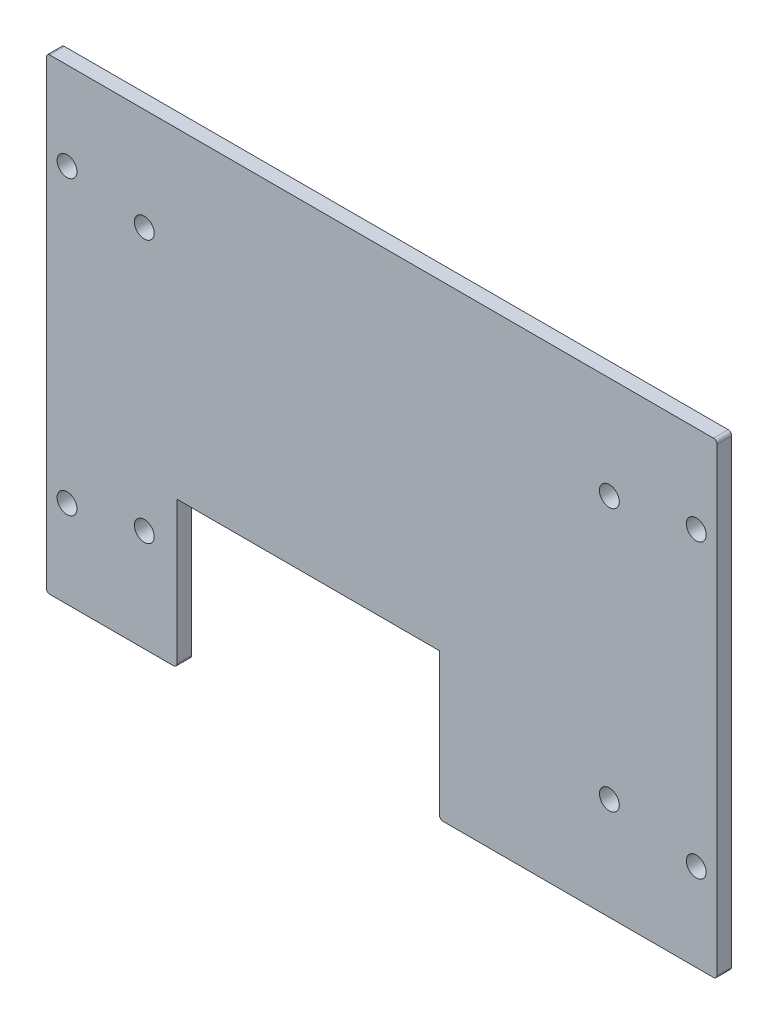
ISO-10303-21;
HEADER;
FILE_DESCRIPTION(('STEP AP214'),'2;1');
FILE_NAME('part.step','',(''),(''),'','','');
FILE_SCHEMA(('AUTOMOTIVE_DESIGN { 1 0 10303 214 1 1 1 1 }'));
ENDSEC;
DATA;
#1=APPLICATION_CONTEXT('core data for automotive mechanical design processes');
#2=APPLICATION_PROTOCOL_DEFINITION('international standard','automotive_design',2000,#1);
#3=PRODUCT_CONTEXT('',#1,'mechanical');
#4=PRODUCT('Part','Part','',(#3));
#5=PRODUCT_RELATED_PRODUCT_CATEGORY('part','',(#4));
#6=PRODUCT_DEFINITION_FORMATION('','',#4);
#7=PRODUCT_DEFINITION_CONTEXT('part definition',#1,'design');
#8=PRODUCT_DEFINITION('design','',#6,#7);
#9=PRODUCT_DEFINITION_SHAPE('','',#8);
#10=(LENGTH_UNIT() NAMED_UNIT(*) SI_UNIT(.MILLI.,.METRE.));
#11=(NAMED_UNIT(*) PLANE_ANGLE_UNIT() SI_UNIT($,.RADIAN.));
#12=(NAMED_UNIT(*) SI_UNIT($,.STERADIAN.) SOLID_ANGLE_UNIT());
#13=UNCERTAINTY_MEASURE_WITH_UNIT(LENGTH_MEASURE(1.E-05),#10,'distance_accuracy_value','');
#14=(GEOMETRIC_REPRESENTATION_CONTEXT(3) GLOBAL_UNCERTAINTY_ASSIGNED_CONTEXT((#13)) GLOBAL_UNIT_ASSIGNED_CONTEXT((#10,
#11,#12)) REPRESENTATION_CONTEXT('',''));
#15=CARTESIAN_POINT('',(0.,0.,0.));
#16=DIRECTION('',(0.,0.,1.));
#17=DIRECTION('',(1.,0.,0.));
#18=AXIS2_PLACEMENT_3D('',#15,#16,#17);
#19=CARTESIAN_POINT('',(0.,0.,3.2004));
#20=DIRECTION('',(0.,1.,0.));
#21=DIRECTION('',(0.,0.,1.));
#22=AXIS2_PLACEMENT_3D('',#19,#20,#21);
#23=PLANE('',#22);
#24=DIRECTION('',(1.,0.,0.));
#25=VECTOR('',#24,1.);
#26=CARTESIAN_POINT('',(0.,0.,0.));
#27=LINE('',#26,#25);
#28=CARTESIAN_POINT('',(0.762,0.,0.));
#29=VERTEX_POINT('',#28);
#30=CARTESIAN_POINT('',(27.67076,0.,0.));
#31=VERTEX_POINT('',#30);
#32=EDGE_CURVE('E187',#29,#31,#27,.T.);
#33=ORIENTED_EDGE('',*,*,#32,.T.);
#34=DIRECTION('',(0.,0.,1.));
#35=VECTOR('',#34,1.);
#36=CARTESIAN_POINT('',(27.67076,0.,3.2004));
#37=LINE('',#36,#35);
#38=CARTESIAN_POINT('',(27.67076,0.,3.2004));
#39=VERTEX_POINT('',#38);
#40=EDGE_CURVE('E227',#31,#39,#37,.T.);
#41=ORIENTED_EDGE('',*,*,#40,.T.);
#42=DIRECTION('',(1.,0.,0.));
#43=VECTOR('',#42,1.);
#44=CARTESIAN_POINT('',(0.,0.,3.2004));
#45=LINE('',#44,#43);
#46=CARTESIAN_POINT('',(0.762,0.,3.2004));
#47=VERTEX_POINT('',#46);
#48=EDGE_CURVE('E171',#47,#39,#45,.T.);
#49=ORIENTED_EDGE('',*,*,#48,.F.);
#50=DIRECTION('',(0.,0.,-1.));
#51=VECTOR('',#50,1.);
#52=CARTESIAN_POINT('',(0.762,0.,3.2004));
#53=LINE('',#52,#51);
#54=EDGE_CURVE('E224',#47,#29,#53,.T.);
#55=ORIENTED_EDGE('',*,*,#54,.T.);
#56=EDGE_LOOP('',(#33,#41,#49,#55));
#57=FACE_BOUND('',#56,.T.);
#58=ADVANCED_FACE('F33',(#57),#23,.F.);
#59=CARTESIAN_POINT('',(0.,101.6,3.2004));
#60=DIRECTION('',(1.,0.,0.));
#61=DIRECTION('',(0.,1.,0.));
#62=AXIS2_PLACEMENT_3D('',#59,#60,#61);
#63=PLANE('',#62);
#64=DIRECTION('',(0.,-1.,0.));
#65=VECTOR('',#64,1.);
#66=CARTESIAN_POINT('',(0.,101.6,0.));
#67=LINE('',#66,#65);
#68=CARTESIAN_POINT('',(0.,100.838,0.));
#69=VERTEX_POINT('',#68);
#70=CARTESIAN_POINT('',(0.,0.761999999999999,0.));
#71=VERTEX_POINT('',#70);
#72=EDGE_CURVE('E180',#69,#71,#67,.T.);
#73=ORIENTED_EDGE('',*,*,#72,.T.);
#74=DIRECTION('',(0.,0.,-1.));
#75=VECTOR('',#74,1.);
#76=CARTESIAN_POINT('',(0.,0.761999999999999,3.2004));
#77=LINE('',#76,#75);
#78=CARTESIAN_POINT('',(0.,0.761999999999999,3.2004));
#79=VERTEX_POINT('',#78);
#80=EDGE_CURVE('E234',#71,#79,#77,.F.);
#81=ORIENTED_EDGE('',*,*,#80,.T.);
#82=DIRECTION('',(0.,-1.,0.));
#83=VECTOR('',#82,1.);
#84=CARTESIAN_POINT('',(0.,101.6,3.2004));
#85=LINE('',#84,#83);
#86=CARTESIAN_POINT('',(0.,100.838,3.2004));
#87=VERTEX_POINT('',#86);
#88=EDGE_CURVE('E167',#87,#79,#85,.T.);
#89=ORIENTED_EDGE('',*,*,#88,.F.);
#90=DIRECTION('',(0.,0.,-1.));
#91=VECTOR('',#90,1.);
#92=CARTESIAN_POINT('',(0.,100.838,3.2004));
#93=LINE('',#92,#91);
#94=EDGE_CURVE('E231',#87,#69,#93,.T.);
#95=ORIENTED_EDGE('',*,*,#94,.T.);
#96=EDGE_LOOP('',(#73,#81,#89,#95));
#97=FACE_BOUND('',#96,.T.);
#98=ADVANCED_FACE('F248',(#97),#63,.F.);
#99=CARTESIAN_POINT('',(86.294760132,0.,0.));
#100=VERTEX_POINT('',#99);
#101=CARTESIAN_POINT('',(145.123353282042,0.,0.));
#102=VERTEX_POINT('',#101);
#103=EDGE_CURVE('E183',#100,#102,#27,.T.);
#104=ORIENTED_EDGE('',*,*,#103,.T.);
#105=DIRECTION('',(0.,0.,-1.));
#106=VECTOR('',#105,1.);
#107=CARTESIAN_POINT('',(145.123353282042,0.,3.2004));
#108=LINE('',#107,#106);
#109=CARTESIAN_POINT('',(145.123353282042,0.,3.2004));
#110=VERTEX_POINT('',#109);
#111=EDGE_CURVE('E211',#102,#110,#108,.F.);
#112=ORIENTED_EDGE('',*,*,#111,.T.);
#113=CARTESIAN_POINT('',(86.294760132,0.,3.2004));
#114=VERTEX_POINT('',#113);
#115=EDGE_CURVE('E169',#114,#110,#45,.T.);
#116=ORIENTED_EDGE('',*,*,#115,.F.);
#117=DIRECTION('',(0.,0.,1.));
#118=VECTOR('',#117,1.);
#119=CARTESIAN_POINT('',(86.294760132,0.,3.2004));
#120=LINE('',#119,#118);
#121=EDGE_CURVE('E209',#114,#100,#120,.F.);
#122=ORIENTED_EDGE('',*,*,#121,.T.);
#123=EDGE_LOOP('',(#104,#112,#116,#122));
#124=FACE_BOUND('',#123,.T.);
#125=ADVANCED_FACE('F346',(#124),#23,.F.);
#126=CARTESIAN_POINT('',(145.885353282042,101.6,3.2004));
#127=DIRECTION('',(-1.,0.,0.));
#128=DIRECTION('',(0.,0.,1.));
#129=AXIS2_PLACEMENT_3D('',#126,#127,#128);
#130=PLANE('',#129);
#131=DIRECTION('',(0.,1.,0.));
#132=VECTOR('',#131,1.);
#133=CARTESIAN_POINT('',(145.885353282042,101.6,3.2004));
#134=LINE('',#133,#132);
#135=CARTESIAN_POINT('',(145.885353282042,0.761999999999999,3.2004));
#136=VERTEX_POINT('',#135);
#137=CARTESIAN_POINT('',(145.885353282042,100.838,3.2004));
#138=VERTEX_POINT('',#137);
#139=EDGE_CURVE('E173',#136,#138,#134,.T.);
#140=ORIENTED_EDGE('',*,*,#139,.F.);
#141=DIRECTION('',(0.,0.,-1.));
#142=VECTOR('',#141,1.);
#143=CARTESIAN_POINT('',(145.885353282042,0.761999999999999,3.2004));
#144=LINE('',#143,#142);
#145=CARTESIAN_POINT('',(145.885353282042,0.761999999999999,0.));
#146=VERTEX_POINT('',#145);
#147=EDGE_CURVE('E194',#136,#146,#144,.T.);
#148=ORIENTED_EDGE('',*,*,#147,.T.);
#149=DIRECTION('',(0.,1.,0.));
#150=VECTOR('',#149,1.);
#151=CARTESIAN_POINT('',(145.885353282042,101.6,0.));
#152=LINE('',#151,#150);
#153=CARTESIAN_POINT('',(145.885353282042,100.838,0.));
#154=VERTEX_POINT('',#153);
#155=EDGE_CURVE('E188',#146,#154,#152,.T.);
#156=ORIENTED_EDGE('',*,*,#155,.T.);
#157=DIRECTION('',(0.,0.,-1.));
#158=VECTOR('',#157,1.);
#159=CARTESIAN_POINT('',(145.885353282042,100.838,3.2004));
#160=LINE('',#159,#158);
#161=EDGE_CURVE('E179',#154,#138,#160,.F.);
#162=ORIENTED_EDGE('',*,*,#161,.T.);
#163=EDGE_LOOP('',(#140,#148,#156,#162));
#164=FACE_BOUND('',#163,.T.);
#165=ADVANCED_FACE('F353',(#164),#130,.F.);
#166=CARTESIAN_POINT('',(0.,101.6,3.2004));
#167=DIRECTION('',(0.,-1.,0.));
#168=DIRECTION('',(0.,0.,-1.));
#169=AXIS2_PLACEMENT_3D('',#166,#167,#168);
#170=PLANE('',#169);
#171=DIRECTION('',(-1.,0.,0.));
#172=VECTOR('',#171,1.);
#173=CARTESIAN_POINT('',(0.,101.6,3.2004));
#174=LINE('',#173,#172);
#175=CARTESIAN_POINT('',(145.123353282042,101.6,3.2004));
#176=VERTEX_POINT('',#175);
#177=CARTESIAN_POINT('',(0.761999999999993,101.6,3.2004));
#178=VERTEX_POINT('',#177);
#179=EDGE_CURVE('E176',#176,#178,#174,.T.);
#180=ORIENTED_EDGE('',*,*,#179,.F.);
#181=DIRECTION('',(0.,0.,-1.));
#182=VECTOR('',#181,1.);
#183=CARTESIAN_POINT('',(145.123353282042,101.6,3.2004));
#184=LINE('',#183,#182);
#185=CARTESIAN_POINT('',(145.123353282042,101.6,0.));
#186=VERTEX_POINT('',#185);
#187=EDGE_CURVE('E11',#176,#186,#184,.T.);
#188=ORIENTED_EDGE('',*,*,#187,.T.);
#189=DIRECTION('',(-1.,0.,0.));
#190=VECTOR('',#189,1.);
#191=CARTESIAN_POINT('',(0.,101.6,0.));
#192=LINE('',#191,#190);
#193=CARTESIAN_POINT('',(0.761999999999993,101.6,0.));
#194=VERTEX_POINT('',#193);
#195=EDGE_CURVE('E170',#186,#194,#192,.T.);
#196=ORIENTED_EDGE('',*,*,#195,.T.);
#197=DIRECTION('',(0.,0.,-1.));
#198=VECTOR('',#197,1.);
#199=CARTESIAN_POINT('',(0.761999999999993,101.6,3.2004));
#200=LINE('',#199,#198);
#201=EDGE_CURVE('E41',#194,#178,#200,.F.);
#202=ORIENTED_EDGE('',*,*,#201,.T.);
#203=EDGE_LOOP('',(#180,#188,#196,#202));
#204=FACE_BOUND('',#203,.T.);
#205=ADVANCED_FACE('F238',(#204),#170,.F.);
#206=CARTESIAN_POINT('',(0.,0.,3.2004));
#207=DIRECTION('',(0.,0.,1.));
#208=DIRECTION('',(1.,0.,0.));
#209=AXIS2_PLACEMENT_3D('',#206,#207,#208);
#210=PLANE('',#209);
#211=CARTESIAN_POINT('',(141.376853282042,19.05,3.2004));
#212=DIRECTION('',(0.,0.,1.));
#213=DIRECTION('',(1.,0.,0.));
#214=AXIS2_PLACEMENT_3D('',#211,#212,#213);
#215=CIRCLE('',#214,2.15899999999999);
#216=CARTESIAN_POINT('',(143.535853282042,19.05,3.2004));
#217=VERTEX_POINT('',#216);
#218=EDGE_CURVE('E292',#217,#217,#215,.T.);
#219=ORIENTED_EDGE('',*,*,#218,.F.);
#220=EDGE_LOOP('',(#219));
#221=FACE_BOUND('',#220,.T.);
#222=CARTESIAN_POINT('',(4.50850000000002,19.05,3.2004));
#223=DIRECTION('',(0.,0.,1.));
#224=DIRECTION('',(1.,0.,0.));
#225=AXIS2_PLACEMENT_3D('',#222,#223,#224);
#226=CIRCLE('',#225,2.159);
#227=CARTESIAN_POINT('',(6.66750000000002,19.05,3.2004));
#228=VERTEX_POINT('',#227);
#229=EDGE_CURVE('E286',#228,#228,#226,.T.);
#230=ORIENTED_EDGE('',*,*,#229,.F.);
#231=EDGE_LOOP('',(#230));
#232=FACE_BOUND('',#231,.T.);
#233=CARTESIAN_POINT('',(4.5085,82.55,3.2004));
#234=DIRECTION('',(0.,0.,1.));
#235=DIRECTION('',(1.,0.,0.));
#236=AXIS2_PLACEMENT_3D('',#233,#234,#235);
#237=CIRCLE('',#236,2.159);
#238=CARTESIAN_POINT('',(6.6675,82.55,3.2004));
#239=VERTEX_POINT('',#238);
#240=EDGE_CURVE('E278',#239,#239,#237,.T.);
#241=ORIENTED_EDGE('',*,*,#240,.F.);
#242=EDGE_LOOP('',(#241));
#243=FACE_BOUND('',#242,.T.);
#244=CARTESIAN_POINT('',(21.31994339,79.3750000000001,3.2004));
#245=DIRECTION('',(0.,0.,1.));
#246=DIRECTION('',(1.,0.,0.));
#247=AXIS2_PLACEMENT_3D('',#244,#245,#246);
#248=CIRCLE('',#247,2.159);
#249=CARTESIAN_POINT('',(23.47894339,79.3750000000001,3.2004));
#250=VERTEX_POINT('',#249);
#251=EDGE_CURVE('E279',#250,#250,#248,.T.);
#252=ORIENTED_EDGE('',*,*,#251,.F.);
#253=EDGE_LOOP('',(#252));
#254=FACE_BOUND('',#253,.T.);
#255=CARTESIAN_POINT('',(122.472903282042,22.225,3.2004));
#256=DIRECTION('',(0.,0.,1.));
#257=DIRECTION('',(1.,0.,0.));
#258=AXIS2_PLACEMENT_3D('',#255,#256,#257);
#259=CIRCLE('',#258,2.15899999999997);
#260=CARTESIAN_POINT('',(124.631903282042,22.225,3.2004));
#261=VERTEX_POINT('',#260);
#262=EDGE_CURVE('E313',#261,#261,#259,.T.);
#263=ORIENTED_EDGE('',*,*,#262,.F.);
#264=EDGE_LOOP('',(#263));
#265=FACE_BOUND('',#264,.T.);
#266=CARTESIAN_POINT('',(122.472903282042,79.3750000000001,3.2004));
#267=DIRECTION('',(0.,0.,1.));
#268=DIRECTION('',(1.,0.,0.));
#269=AXIS2_PLACEMENT_3D('',#266,#267,#268);
#270=CIRCLE('',#269,2.15899999999999);
#271=CARTESIAN_POINT('',(124.631903282042,79.3750000000001,3.2004));
#272=VERTEX_POINT('',#271);
#273=EDGE_CURVE('E303',#272,#272,#270,.T.);
#274=ORIENTED_EDGE('',*,*,#273,.F.);
#275=EDGE_LOOP('',(#274));
#276=FACE_BOUND('',#275,.T.);
#277=CARTESIAN_POINT('',(21.31994339,22.2249999999999,3.2004));
#278=DIRECTION('',(0.,0.,1.));
#279=DIRECTION('',(1.,0.,0.));
#280=AXIS2_PLACEMENT_3D('',#277,#278,#279);
#281=CIRCLE('',#280,2.159);
#282=CARTESIAN_POINT('',(23.47894339,22.2249999999999,3.2004));
#283=VERTEX_POINT('',#282);
#284=EDGE_CURVE('E302',#283,#283,#281,.T.);
#285=ORIENTED_EDGE('',*,*,#284,.F.);
#286=EDGE_LOOP('',(#285));
#287=FACE_BOUND('',#286,.T.);
#288=CARTESIAN_POINT('',(141.376853282042,82.55,3.2004));
#289=DIRECTION('',(0.,0.,1.));
#290=DIRECTION('',(1.,0.,0.));
#291=AXIS2_PLACEMENT_3D('',#288,#289,#290);
#292=CIRCLE('',#291,2.15899999999999);
#293=CARTESIAN_POINT('',(143.535853282042,82.55,3.2004));
#294=VERTEX_POINT('',#293);
#295=EDGE_CURVE('E271',#294,#294,#292,.T.);
#296=ORIENTED_EDGE('',*,*,#295,.F.);
#297=EDGE_LOOP('',(#296));
#298=FACE_BOUND('',#297,.T.);
#299=ORIENTED_EDGE('',*,*,#115,.T.);
#300=CARTESIAN_POINT('',(145.123353282042,0.761999999999999,3.2004));
#301=DIRECTION('',(0.,0.,1.));
#302=DIRECTION('',(1.,0.,0.));
#303=AXIS2_PLACEMENT_3D('',#300,#301,#302);
#304=CIRCLE('',#303,0.762);
#305=EDGE_CURVE('E221',#110,#136,#304,.T.);
#306=ORIENTED_EDGE('',*,*,#305,.T.);
#307=ORIENTED_EDGE('',*,*,#139,.T.);
#308=CARTESIAN_POINT('',(145.123353282042,100.838,3.2004));
#309=DIRECTION('',(0.,0.,1.));
#310=DIRECTION('',(1.,0.,0.));
#311=AXIS2_PLACEMENT_3D('',#308,#309,#310);
#312=CIRCLE('',#311,0.762);
#313=EDGE_CURVE('E215',#138,#176,#312,.T.);
#314=ORIENTED_EDGE('',*,*,#313,.T.);
#315=ORIENTED_EDGE('',*,*,#179,.T.);
#316=CARTESIAN_POINT('',(0.761999999999993,100.838,3.2004));
#317=DIRECTION('',(0.,0.,1.));
#318=DIRECTION('',(1.,0.,0.));
#319=AXIS2_PLACEMENT_3D('',#316,#317,#318);
#320=CIRCLE('',#319,0.762);
#321=EDGE_CURVE('E213',#178,#87,#320,.T.);
#322=ORIENTED_EDGE('',*,*,#321,.T.);
#323=ORIENTED_EDGE('',*,*,#88,.T.);
#324=CARTESIAN_POINT('',(0.762,0.762,3.2004));
#325=DIRECTION('',(0.,0.,1.));
#326=DIRECTION('',(1.,0.,0.));
#327=AXIS2_PLACEMENT_3D('',#324,#325,#326);
#328=CIRCLE('',#327,0.762);
#329=EDGE_CURVE('E56',#79,#47,#328,.T.);
#330=ORIENTED_EDGE('',*,*,#329,.T.);
#331=ORIENTED_EDGE('',*,*,#48,.T.);
#332=CARTESIAN_POINT('',(27.67076,0.762,3.2004));
#333=DIRECTION('',(0.,0.,1.));
#334=DIRECTION('',(1.,0.,0.));
#335=AXIS2_PLACEMENT_3D('',#332,#333,#334);
#336=CIRCLE('',#335,0.762);
#337=CARTESIAN_POINT('',(28.43276,0.761999999999999,3.2004));
#338=VERTEX_POINT('',#337);
#339=EDGE_CURVE('E48',#39,#338,#336,.T.);
#340=ORIENTED_EDGE('',*,*,#339,.T.);
#341=DIRECTION('',(0.,-1.,0.));
#342=VECTOR('',#341,1.);
#343=CARTESIAN_POINT('',(28.43276,31.75,3.2004));
#344=LINE('',#343,#342);
#345=CARTESIAN_POINT('',(28.43276,31.75,3.2004));
#346=VERTEX_POINT('',#345);
#347=EDGE_CURVE('E147',#346,#338,#344,.T.);
#348=ORIENTED_EDGE('',*,*,#347,.F.);
#349=DIRECTION('',(-1.,0.,0.));
#350=VECTOR('',#349,1.);
#351=CARTESIAN_POINT('',(28.43276,31.75,3.2004));
#352=LINE('',#351,#350);
#353=CARTESIAN_POINT('',(85.532760132,31.75,3.2004));
#354=VERTEX_POINT('',#353);
#355=EDGE_CURVE('E146',#354,#346,#352,.T.);
#356=ORIENTED_EDGE('',*,*,#355,.F.);
#357=DIRECTION('',(0.,1.,0.));
#358=VECTOR('',#357,1.);
#359=CARTESIAN_POINT('',(85.532760132,31.75,3.2004));
#360=LINE('',#359,#358);
#361=CARTESIAN_POINT('',(85.532760132,0.761999999999999,3.2004));
#362=VERTEX_POINT('',#361);
#363=EDGE_CURVE('E137',#362,#354,#360,.T.);
#364=ORIENTED_EDGE('',*,*,#363,.F.);
#365=CARTESIAN_POINT('',(86.294760132,0.761999999999999,3.20040000000001));
#366=DIRECTION('',(0.,0.,1.));
#367=DIRECTION('',(1.,0.,0.));
#368=AXIS2_PLACEMENT_3D('',#365,#366,#367);
#369=CIRCLE('',#368,0.762);
#370=EDGE_CURVE('E219',#362,#114,#369,.T.);
#371=ORIENTED_EDGE('',*,*,#370,.T.);
#372=EDGE_LOOP('',(#299,#306,#307,#314,#315,#322,#323,#330,#331,#340,#348,#356,#364,#371));
#373=FACE_BOUND('',#372,.T.);
#374=ADVANCED_FACE('F160',(#221,#232,#243,#254,#265,#276,#287,#298,#373),#210,.T.);
#375=CARTESIAN_POINT('',(0.,0.,0.));
#376=DIRECTION('',(0.,0.,1.));
#377=DIRECTION('',(1.,0.,0.));
#378=AXIS2_PLACEMENT_3D('',#375,#376,#377);
#379=PLANE('',#378);
#380=CARTESIAN_POINT('',(141.376853282042,19.05,0.));
#381=DIRECTION('',(0.,0.,1.));
#382=DIRECTION('',(1.,0.,0.));
#383=AXIS2_PLACEMENT_3D('',#380,#381,#382);
#384=CIRCLE('',#383,2.15899999999999);
#385=CARTESIAN_POINT('',(143.535853282042,19.05,0.));
#386=VERTEX_POINT('',#385);
#387=EDGE_CURVE('E274',#386,#386,#384,.F.);
#388=ORIENTED_EDGE('',*,*,#387,.F.);
#389=EDGE_LOOP('',(#388));
#390=FACE_BOUND('',#389,.T.);
#391=CARTESIAN_POINT('',(4.50850000000002,19.05,0.));
#392=DIRECTION('',(0.,0.,1.));
#393=DIRECTION('',(1.,0.,0.));
#394=AXIS2_PLACEMENT_3D('',#391,#392,#393);
#395=CIRCLE('',#394,2.159);
#396=CARTESIAN_POINT('',(6.66750000000002,19.05,0.));
#397=VERTEX_POINT('',#396);
#398=EDGE_CURVE('E289',#397,#397,#395,.F.);
#399=ORIENTED_EDGE('',*,*,#398,.F.);
#400=EDGE_LOOP('',(#399));
#401=FACE_BOUND('',#400,.T.);
#402=CARTESIAN_POINT('',(4.5085,82.55,0.));
#403=DIRECTION('',(0.,0.,1.));
#404=DIRECTION('',(1.,0.,0.));
#405=AXIS2_PLACEMENT_3D('',#402,#403,#404);
#406=CIRCLE('',#405,2.159);
#407=CARTESIAN_POINT('',(6.6675,82.55,0.));
#408=VERTEX_POINT('',#407);
#409=EDGE_CURVE('E283',#408,#408,#406,.F.);
#410=ORIENTED_EDGE('',*,*,#409,.F.);
#411=EDGE_LOOP('',(#410));
#412=FACE_BOUND('',#411,.T.);
#413=CARTESIAN_POINT('',(21.31994339,79.3750000000001,0.));
#414=DIRECTION('',(0.,0.,1.));
#415=DIRECTION('',(1.,0.,0.));
#416=AXIS2_PLACEMENT_3D('',#413,#414,#415);
#417=CIRCLE('',#416,2.159);
#418=CARTESIAN_POINT('',(23.47894339,79.3750000000001,0.));
#419=VERTEX_POINT('',#418);
#420=EDGE_CURVE('E275',#419,#419,#417,.F.);
#421=ORIENTED_EDGE('',*,*,#420,.F.);
#422=EDGE_LOOP('',(#421));
#423=FACE_BOUND('',#422,.T.);
#424=CARTESIAN_POINT('',(122.472903282042,22.225,0.));
#425=DIRECTION('',(0.,0.,1.));
#426=DIRECTION('',(1.,0.,0.));
#427=AXIS2_PLACEMENT_3D('',#424,#425,#426);
#428=CIRCLE('',#427,2.15899999999997);
#429=CARTESIAN_POINT('',(124.631903282042,22.225,0.));
#430=VERTEX_POINT('',#429);
#431=EDGE_CURVE('E306',#430,#430,#428,.F.);
#432=ORIENTED_EDGE('',*,*,#431,.F.);
#433=EDGE_LOOP('',(#432));
#434=FACE_BOUND('',#433,.T.);
#435=CARTESIAN_POINT('',(122.472903282042,79.3750000000001,0.));
#436=DIRECTION('',(0.,0.,1.));
#437=DIRECTION('',(1.,0.,0.));
#438=AXIS2_PLACEMENT_3D('',#435,#436,#437);
#439=CIRCLE('',#438,2.15899999999999);
#440=CARTESIAN_POINT('',(124.631903282042,79.3750000000001,0.));
#441=VERTEX_POINT('',#440);
#442=EDGE_CURVE('E299',#441,#441,#439,.F.);
#443=ORIENTED_EDGE('',*,*,#442,.F.);
#444=EDGE_LOOP('',(#443));
#445=FACE_BOUND('',#444,.T.);
#446=CARTESIAN_POINT('',(21.31994339,22.2249999999999,0.));
#447=DIRECTION('',(0.,0.,1.));
#448=DIRECTION('',(1.,0.,0.));
#449=AXIS2_PLACEMENT_3D('',#446,#447,#448);
#450=CIRCLE('',#449,2.159);
#451=CARTESIAN_POINT('',(23.47894339,22.2249999999999,0.));
#452=VERTEX_POINT('',#451);
#453=EDGE_CURVE('E282',#452,#452,#450,.F.);
#454=ORIENTED_EDGE('',*,*,#453,.F.);
#455=EDGE_LOOP('',(#454));
#456=FACE_BOUND('',#455,.T.);
#457=CARTESIAN_POINT('',(141.376853282042,82.55,0.));
#458=DIRECTION('',(0.,0.,1.));
#459=DIRECTION('',(1.,0.,0.));
#460=AXIS2_PLACEMENT_3D('',#457,#458,#459);
#461=CIRCLE('',#460,2.15899999999999);
#462=CARTESIAN_POINT('',(143.535853282042,82.55,0.));
#463=VERTEX_POINT('',#462);
#464=EDGE_CURVE('E262',#463,#463,#461,.F.);
#465=ORIENTED_EDGE('',*,*,#464,.F.);
#466=EDGE_LOOP('',(#465));
#467=FACE_BOUND('',#466,.T.);
#468=ORIENTED_EDGE('',*,*,#155,.F.);
#469=CARTESIAN_POINT('',(145.123353282042,0.761999999999999,0.));
#470=DIRECTION('',(0.,0.,1.));
#471=DIRECTION('',(1.,0.,0.));
#472=AXIS2_PLACEMENT_3D('',#469,#470,#471);
#473=CIRCLE('',#472,0.762);
#474=EDGE_CURVE('E207',#146,#102,#473,.F.);
#475=ORIENTED_EDGE('',*,*,#474,.T.);
#476=ORIENTED_EDGE('',*,*,#103,.F.);
#477=CARTESIAN_POINT('',(86.294760132,0.761999999999999,0.));
#478=DIRECTION('',(0.,0.,1.));
#479=DIRECTION('',(1.,0.,0.));
#480=AXIS2_PLACEMENT_3D('',#477,#478,#479);
#481=CIRCLE('',#480,0.762);
#482=CARTESIAN_POINT('',(85.532760132,0.761999999999999,0.));
#483=VERTEX_POINT('',#482);
#484=EDGE_CURVE('E205',#100,#483,#481,.F.);
#485=ORIENTED_EDGE('',*,*,#484,.T.);
#486=DIRECTION('',(0.,-1.,0.));
#487=VECTOR('',#486,1.);
#488=CARTESIAN_POINT('',(85.532760132,31.75,0.));
#489=LINE('',#488,#487);
#490=CARTESIAN_POINT('',(85.532760132,31.75,0.));
#491=VERTEX_POINT('',#490);
#492=EDGE_CURVE('E165',#491,#483,#489,.T.);
#493=ORIENTED_EDGE('',*,*,#492,.F.);
#494=DIRECTION('',(1.,0.,0.));
#495=VECTOR('',#494,1.);
#496=CARTESIAN_POINT('',(28.43276,31.75,0.));
#497=LINE('',#496,#495);
#498=CARTESIAN_POINT('',(28.43276,31.75,0.));
#499=VERTEX_POINT('',#498);
#500=EDGE_CURVE('E155',#499,#491,#497,.T.);
#501=ORIENTED_EDGE('',*,*,#500,.F.);
#502=DIRECTION('',(0.,1.,0.));
#503=VECTOR('',#502,1.);
#504=CARTESIAN_POINT('',(28.43276,31.75,0.));
#505=LINE('',#504,#503);
#506=CARTESIAN_POINT('',(28.43276,0.761999999999999,0.));
#507=VERTEX_POINT('',#506);
#508=EDGE_CURVE('E184',#507,#499,#505,.T.);
#509=ORIENTED_EDGE('',*,*,#508,.F.);
#510=CARTESIAN_POINT('',(27.67076,0.762,0.));
#511=DIRECTION('',(0.,0.,1.));
#512=DIRECTION('',(1.,0.,0.));
#513=AXIS2_PLACEMENT_3D('',#510,#511,#512);
#514=CIRCLE('',#513,0.762);
#515=EDGE_CURVE('E203',#507,#31,#514,.F.);
#516=ORIENTED_EDGE('',*,*,#515,.T.);
#517=ORIENTED_EDGE('',*,*,#32,.F.);
#518=CARTESIAN_POINT('',(0.762,0.762,0.));
#519=DIRECTION('',(0.,0.,1.));
#520=DIRECTION('',(1.,0.,0.));
#521=AXIS2_PLACEMENT_3D('',#518,#519,#520);
#522=CIRCLE('',#521,0.762);
#523=EDGE_CURVE('E201',#29,#71,#522,.F.);
#524=ORIENTED_EDGE('',*,*,#523,.T.);
#525=ORIENTED_EDGE('',*,*,#72,.F.);
#526=CARTESIAN_POINT('',(0.761999999999993,100.838,0.));
#527=DIRECTION('',(0.,0.,1.));
#528=DIRECTION('',(1.,0.,0.));
#529=AXIS2_PLACEMENT_3D('',#526,#527,#528);
#530=CIRCLE('',#529,0.762);
#531=EDGE_CURVE('E197',#69,#194,#530,.F.);
#532=ORIENTED_EDGE('',*,*,#531,.T.);
#533=ORIENTED_EDGE('',*,*,#195,.F.);
#534=CARTESIAN_POINT('',(145.123353282042,100.838,0.));
#535=DIRECTION('',(0.,0.,1.));
#536=DIRECTION('',(1.,0.,0.));
#537=AXIS2_PLACEMENT_3D('',#534,#535,#536);
#538=CIRCLE('',#537,0.762);
#539=EDGE_CURVE('E199',#186,#154,#538,.F.);
#540=ORIENTED_EDGE('',*,*,#539,.T.);
#541=EDGE_LOOP('',(#468,#475,#476,#485,#493,#501,#509,#516,#517,#524,#525,#532,#533,#540));
#542=FACE_BOUND('',#541,.T.);
#543=ADVANCED_FACE('F252',(#390,#401,#412,#423,#434,#445,#456,#467,#542),#379,.F.);
#544=CARTESIAN_POINT('',(28.43276,31.75,-65.3335481592298));
#545=DIRECTION('',(-1.,0.,0.));
#546=DIRECTION('',(0.,0.,1.));
#547=AXIS2_PLACEMENT_3D('',#544,#545,#546);
#548=PLANE('',#547);
#549=ORIENTED_EDGE('',*,*,#347,.T.);
#550=DIRECTION('',(0.,0.,1.));
#551=VECTOR('',#550,1.);
#552=CARTESIAN_POINT('',(28.43276,0.761999999999999,-65.3335481592298));
#553=LINE('',#552,#551);
#554=EDGE_CURVE('E229',#338,#507,#553,.F.);
#555=ORIENTED_EDGE('',*,*,#554,.T.);
#556=ORIENTED_EDGE('',*,*,#508,.T.);
#557=DIRECTION('',(0.,0.,1.));
#558=VECTOR('',#557,1.);
#559=CARTESIAN_POINT('',(28.43276,31.75,-65.3335481592298));
#560=LINE('',#559,#558);
#561=EDGE_CURVE('E157',#499,#346,#560,.T.);
#562=ORIENTED_EDGE('',*,*,#561,.T.);
#563=EDGE_LOOP('',(#549,#555,#556,#562));
#564=FACE_BOUND('',#563,.T.);
#565=ADVANCED_FACE('F260',(#564),#548,.F.);
#566=CARTESIAN_POINT('',(28.43276,31.75,-65.3335481592298));
#567=DIRECTION('',(0.,1.,0.));
#568=DIRECTION('',(0.,0.,1.));
#569=AXIS2_PLACEMENT_3D('',#566,#567,#568);
#570=PLANE('',#569);
#571=ORIENTED_EDGE('',*,*,#500,.T.);
#572=DIRECTION('',(0.,0.,1.));
#573=VECTOR('',#572,1.);
#574=CARTESIAN_POINT('',(85.532760132,31.75,-65.3335481592298));
#575=LINE('',#574,#573);
#576=EDGE_CURVE('E141',#491,#354,#575,.T.);
#577=ORIENTED_EDGE('',*,*,#576,.T.);
#578=ORIENTED_EDGE('',*,*,#355,.T.);
#579=ORIENTED_EDGE('',*,*,#561,.F.);
#580=EDGE_LOOP('',(#571,#577,#578,#579));
#581=FACE_BOUND('',#580,.T.);
#582=ADVANCED_FACE('F151',(#581),#570,.F.);
#583=CARTESIAN_POINT('',(85.532760132,31.75,-65.3335481592298));
#584=DIRECTION('',(1.,0.,0.));
#585=DIRECTION('',(0.,1.,0.));
#586=AXIS2_PLACEMENT_3D('',#583,#584,#585);
#587=PLANE('',#586);
#588=ORIENTED_EDGE('',*,*,#492,.T.);
#589=DIRECTION('',(0.,0.,1.));
#590=VECTOR('',#589,1.);
#591=CARTESIAN_POINT('',(85.532760132,0.761999999999999,-65.3335481592298));
#592=LINE('',#591,#590);
#593=EDGE_CURVE('E144',#483,#362,#592,.T.);
#594=ORIENTED_EDGE('',*,*,#593,.T.);
#595=ORIENTED_EDGE('',*,*,#363,.T.);
#596=ORIENTED_EDGE('',*,*,#576,.F.);
#597=EDGE_LOOP('',(#588,#594,#595,#596));
#598=FACE_BOUND('',#597,.T.);
#599=ADVANCED_FACE('F140',(#598),#587,.F.);
#600=CARTESIAN_POINT('',(141.376853282042,82.55,-6.10657416232704));
#601=DIRECTION('',(0.,0.,1.));
#602=DIRECTION('',(1.,0.,0.));
#603=AXIS2_PLACEMENT_3D('',#600,#601,#602);
#604=CYLINDRICAL_SURFACE('',#603,2.15899999999999);
#605=ORIENTED_EDGE('',*,*,#464,.T.);
#606=EDGE_LOOP('',(#605));
#607=FACE_BOUND('',#606,.T.);
#608=ORIENTED_EDGE('',*,*,#295,.T.);
#609=EDGE_LOOP('',(#608));
#610=FACE_BOUND('',#609,.T.);
#611=ADVANCED_FACE('F329',(#607,#610),#604,.F.);
#612=CARTESIAN_POINT('',(21.31994339,22.2249999999999,-6.10657416232704));
#613=DIRECTION('',(0.,0.,1.));
#614=DIRECTION('',(1.,0.,0.));
#615=AXIS2_PLACEMENT_3D('',#612,#613,#614);
#616=CYLINDRICAL_SURFACE('',#615,2.159);
#617=ORIENTED_EDGE('',*,*,#453,.T.);
#618=EDGE_LOOP('',(#617));
#619=FACE_BOUND('',#618,.T.);
#620=ORIENTED_EDGE('',*,*,#284,.T.);
#621=EDGE_LOOP('',(#620));
#622=FACE_BOUND('',#621,.T.);
#623=ADVANCED_FACE('F331',(#619,#622),#616,.F.);
#624=CARTESIAN_POINT('',(122.472903282042,79.3750000000001,-6.10657416232704));
#625=DIRECTION('',(0.,0.,1.));
#626=DIRECTION('',(1.,0.,0.));
#627=AXIS2_PLACEMENT_3D('',#624,#625,#626);
#628=CYLINDRICAL_SURFACE('',#627,2.15899999999999);
#629=ORIENTED_EDGE('',*,*,#442,.T.);
#630=EDGE_LOOP('',(#629));
#631=FACE_BOUND('',#630,.T.);
#632=ORIENTED_EDGE('',*,*,#273,.T.);
#633=EDGE_LOOP('',(#632));
#634=FACE_BOUND('',#633,.T.);
#635=ADVANCED_FACE('F338',(#631,#634),#628,.F.);
#636=CARTESIAN_POINT('',(122.472903282042,22.225,-6.10657416232704));
#637=DIRECTION('',(0.,0.,1.));
#638=DIRECTION('',(1.,0.,0.));
#639=AXIS2_PLACEMENT_3D('',#636,#637,#638);
#640=CYLINDRICAL_SURFACE('',#639,2.15899999999997);
#641=ORIENTED_EDGE('',*,*,#431,.T.);
#642=EDGE_LOOP('',(#641));
#643=FACE_BOUND('',#642,.T.);
#644=ORIENTED_EDGE('',*,*,#262,.T.);
#645=EDGE_LOOP('',(#644));
#646=FACE_BOUND('',#645,.T.);
#647=ADVANCED_FACE('F317',(#643,#646),#640,.F.);
#648=CARTESIAN_POINT('',(21.31994339,79.3750000000001,-6.10657416232704));
#649=DIRECTION('',(0.,0.,1.));
#650=DIRECTION('',(1.,0.,0.));
#651=AXIS2_PLACEMENT_3D('',#648,#649,#650);
#652=CYLINDRICAL_SURFACE('',#651,2.159);
#653=ORIENTED_EDGE('',*,*,#420,.T.);
#654=EDGE_LOOP('',(#653));
#655=FACE_BOUND('',#654,.T.);
#656=ORIENTED_EDGE('',*,*,#251,.T.);
#657=EDGE_LOOP('',(#656));
#658=FACE_BOUND('',#657,.T.);
#659=ADVANCED_FACE('F403',(#655,#658),#652,.F.);
#660=CARTESIAN_POINT('',(4.5085,82.55,-6.10657416232704));
#661=DIRECTION('',(0.,0.,1.));
#662=DIRECTION('',(1.,0.,0.));
#663=AXIS2_PLACEMENT_3D('',#660,#661,#662);
#664=CYLINDRICAL_SURFACE('',#663,2.159);
#665=ORIENTED_EDGE('',*,*,#409,.T.);
#666=EDGE_LOOP('',(#665));
#667=FACE_BOUND('',#666,.T.);
#668=ORIENTED_EDGE('',*,*,#240,.T.);
#669=EDGE_LOOP('',(#668));
#670=FACE_BOUND('',#669,.T.);
#671=ADVANCED_FACE('F396',(#667,#670),#664,.F.);
#672=CARTESIAN_POINT('',(4.50850000000002,19.05,-6.10657416232704));
#673=DIRECTION('',(0.,0.,1.));
#674=DIRECTION('',(1.,0.,0.));
#675=AXIS2_PLACEMENT_3D('',#672,#673,#674);
#676=CYLINDRICAL_SURFACE('',#675,2.159);
#677=ORIENTED_EDGE('',*,*,#398,.T.);
#678=EDGE_LOOP('',(#677));
#679=FACE_BOUND('',#678,.T.);
#680=ORIENTED_EDGE('',*,*,#229,.T.);
#681=EDGE_LOOP('',(#680));
#682=FACE_BOUND('',#681,.T.);
#683=ADVANCED_FACE('F390',(#679,#682),#676,.F.);
#684=CARTESIAN_POINT('',(141.376853282042,19.05,-6.10657416232704));
#685=DIRECTION('',(0.,0.,1.));
#686=DIRECTION('',(1.,0.,0.));
#687=AXIS2_PLACEMENT_3D('',#684,#685,#686);
#688=CYLINDRICAL_SURFACE('',#687,2.15899999999999);
#689=ORIENTED_EDGE('',*,*,#387,.T.);
#690=EDGE_LOOP('',(#689));
#691=FACE_BOUND('',#690,.T.);
#692=ORIENTED_EDGE('',*,*,#218,.T.);
#693=EDGE_LOOP('',(#692));
#694=FACE_BOUND('',#693,.T.);
#695=ADVANCED_FACE('F386',(#691,#694),#688,.F.);
#696=CARTESIAN_POINT('',(145.123353282042,0.761999999999999,3.2004));
#697=DIRECTION('',(0.,0.,-1.));
#698=DIRECTION('',(-1.,0.,0.));
#699=AXIS2_PLACEMENT_3D('',#696,#697,#698);
#700=CYLINDRICAL_SURFACE('',#699,0.762);
#701=ORIENTED_EDGE('',*,*,#305,.F.);
#702=ORIENTED_EDGE('',*,*,#111,.F.);
#703=ORIENTED_EDGE('',*,*,#474,.F.);
#704=ORIENTED_EDGE('',*,*,#147,.F.);
#705=EDGE_LOOP('',(#701,#702,#703,#704));
#706=FACE_BOUND('',#705,.T.);
#707=ADVANCED_FACE('F366',(#706),#700,.T.);
#708=CARTESIAN_POINT('',(86.294760132,0.761999999999999,-65.3335481592298));
#709=DIRECTION('',(0.,0.,1.));
#710=DIRECTION('',(1.,0.,0.));
#711=AXIS2_PLACEMENT_3D('',#708,#709,#710);
#712=CYLINDRICAL_SURFACE('',#711,0.762);
#713=ORIENTED_EDGE('',*,*,#484,.F.);
#714=ORIENTED_EDGE('',*,*,#121,.F.);
#715=ORIENTED_EDGE('',*,*,#370,.F.);
#716=ORIENTED_EDGE('',*,*,#593,.F.);
#717=EDGE_LOOP('',(#713,#714,#715,#716));
#718=FACE_BOUND('',#717,.T.);
#719=ADVANCED_FACE('F381',(#718),#712,.T.);
#720=CARTESIAN_POINT('',(27.67076,0.762,3.2004));
#721=DIRECTION('',(0.,0.,1.));
#722=DIRECTION('',(1.,0.,0.));
#723=AXIS2_PLACEMENT_3D('',#720,#721,#722);
#724=CYLINDRICAL_SURFACE('',#723,0.762);
#725=ORIENTED_EDGE('',*,*,#515,.F.);
#726=ORIENTED_EDGE('',*,*,#554,.F.);
#727=ORIENTED_EDGE('',*,*,#339,.F.);
#728=ORIENTED_EDGE('',*,*,#40,.F.);
#729=EDGE_LOOP('',(#725,#726,#727,#728));
#730=FACE_BOUND('',#729,.T.);
#731=ADVANCED_FACE('F264',(#730),#724,.T.);
#732=CARTESIAN_POINT('',(0.762,0.762,3.2004));
#733=DIRECTION('',(0.,0.,-1.));
#734=DIRECTION('',(-1.,0.,0.));
#735=AXIS2_PLACEMENT_3D('',#732,#733,#734);
#736=CYLINDRICAL_SURFACE('',#735,0.762);
#737=ORIENTED_EDGE('',*,*,#329,.F.);
#738=ORIENTED_EDGE('',*,*,#80,.F.);
#739=ORIENTED_EDGE('',*,*,#523,.F.);
#740=ORIENTED_EDGE('',*,*,#54,.F.);
#741=EDGE_LOOP('',(#737,#738,#739,#740));
#742=FACE_BOUND('',#741,.T.);
#743=ADVANCED_FACE('F257',(#742),#736,.T.);
#744=CARTESIAN_POINT('',(145.123353282042,100.838,3.2004));
#745=DIRECTION('',(0.,0.,-1.));
#746=DIRECTION('',(-1.,0.,0.));
#747=AXIS2_PLACEMENT_3D('',#744,#745,#746);
#748=CYLINDRICAL_SURFACE('',#747,0.762);
#749=ORIENTED_EDGE('',*,*,#313,.F.);
#750=ORIENTED_EDGE('',*,*,#161,.F.);
#751=ORIENTED_EDGE('',*,*,#539,.F.);
#752=ORIENTED_EDGE('',*,*,#187,.F.);
#753=EDGE_LOOP('',(#749,#750,#751,#752));
#754=FACE_BOUND('',#753,.T.);
#755=ADVANCED_FACE('F371',(#754),#748,.T.);
#756=CARTESIAN_POINT('',(0.761999999999993,100.838,3.2004));
#757=DIRECTION('',(0.,0.,-1.));
#758=DIRECTION('',(-1.,0.,0.));
#759=AXIS2_PLACEMENT_3D('',#756,#757,#758);
#760=CYLINDRICAL_SURFACE('',#759,0.762);
#761=ORIENTED_EDGE('',*,*,#321,.F.);
#762=ORIENTED_EDGE('',*,*,#201,.F.);
#763=ORIENTED_EDGE('',*,*,#531,.F.);
#764=ORIENTED_EDGE('',*,*,#94,.F.);
#765=EDGE_LOOP('',(#761,#762,#763,#764));
#766=FACE_BOUND('',#765,.T.);
#767=ADVANCED_FACE('F35',(#766),#760,.T.);
#768=CLOSED_SHELL('',(#58,#98,#125,#165,#205,#374,#543,#565,#582,#599,#611,#623,#635,#647,#659,
#671,#683,#695,#707,#719,#731,#743,#755,#767));
#769=MANIFOLD_SOLID_BREP('B2',#768);
#770=ADVANCED_BREP_SHAPE_REPRESENTATION('',(#18,#769),#14);
#771=SHAPE_DEFINITION_REPRESENTATION(#9,#770);
ENDSEC;
END-ISO-10303-21;
